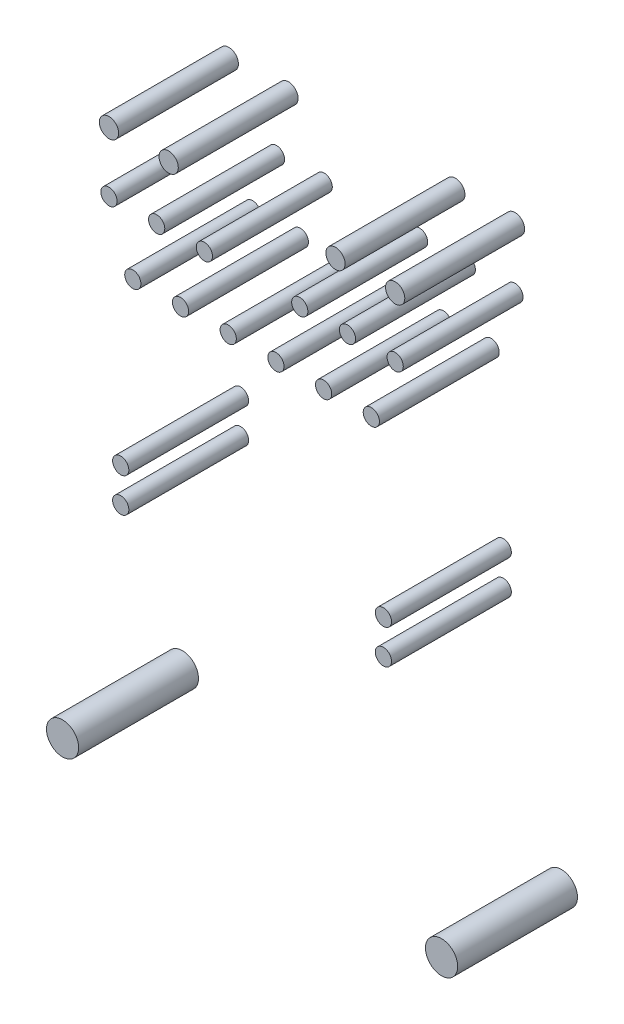
ISO-10303-21;
HEADER;
FILE_DESCRIPTION(('STEP AP214'),'2;1');
FILE_NAME('part.step','',(''),(''),'','','');
FILE_SCHEMA(('AUTOMOTIVE_DESIGN { 1 0 10303 214 1 1 1 1 }'));
ENDSEC;
DATA;
#1=APPLICATION_CONTEXT('core data for automotive mechanical design processes');
#2=APPLICATION_PROTOCOL_DEFINITION('international standard','automotive_design',2000,#1);
#3=PRODUCT_CONTEXT('',#1,'mechanical');
#4=PRODUCT('Part','Part','',(#3));
#5=PRODUCT_RELATED_PRODUCT_CATEGORY('part','',(#4));
#6=PRODUCT_DEFINITION_FORMATION('','',#4);
#7=PRODUCT_DEFINITION_CONTEXT('part definition',#1,'design');
#8=PRODUCT_DEFINITION('design','',#6,#7);
#9=PRODUCT_DEFINITION_SHAPE('','',#8);
#10=(LENGTH_UNIT() NAMED_UNIT(*) SI_UNIT(.MILLI.,.METRE.));
#11=(NAMED_UNIT(*) PLANE_ANGLE_UNIT() SI_UNIT($,.RADIAN.));
#12=(NAMED_UNIT(*) SI_UNIT($,.STERADIAN.) SOLID_ANGLE_UNIT());
#13=UNCERTAINTY_MEASURE_WITH_UNIT(LENGTH_MEASURE(1.E-05),#10,'distance_accuracy_value','');
#14=(GEOMETRIC_REPRESENTATION_CONTEXT(3) GLOBAL_UNCERTAINTY_ASSIGNED_CONTEXT((#13)) GLOBAL_UNIT_ASSIGNED_CONTEXT((#10,
#11,#12)) REPRESENTATION_CONTEXT('',''));
#15=CARTESIAN_POINT('',(0.,0.,0.));
#16=DIRECTION('',(0.,0.,1.));
#17=DIRECTION('',(1.,0.,0.));
#18=AXIS2_PLACEMENT_3D('',#15,#16,#17);
#19=CARTESIAN_POINT('',(0.,0.,-5.));
#20=DIRECTION('',(0.,0.,1.));
#21=DIRECTION('',(1.,0.,0.));
#22=AXIS2_PLACEMENT_3D('',#19,#20,#21);
#23=PLANE('',#22);
#24=CARTESIAN_POINT('',(0.,0.,-5.));
#25=DIRECTION('',(0.,0.,1.));
#26=DIRECTION('',(1.,0.,0.));
#27=AXIS2_PLACEMENT_3D('',#24,#25,#26);
#28=CIRCLE('',#27,0.345);
#29=CARTESIAN_POINT('',(0.345,0.,-5.));
#30=VERTEX_POINT('',#29);
#31=EDGE_CURVE('P0_E11',#30,#30,#28,.T.);
#32=ORIENTED_EDGE('',*,*,#31,.F.);
#33=EDGE_LOOP('',(#32));
#34=FACE_BOUND('',#33,.T.);
#35=ADVANCED_FACE('P0_F16',(#34),#23,.F.);
#36=CARTESIAN_POINT('',(0.,0.,0.1));
#37=DIRECTION('',(0.,0.,1.));
#38=DIRECTION('',(1.,0.,0.));
#39=AXIS2_PLACEMENT_3D('',#36,#37,#38);
#40=PLANE('',#39);
#41=CARTESIAN_POINT('',(0.,0.,0.1));
#42=DIRECTION('',(0.,0.,1.));
#43=DIRECTION('',(1.,0.,0.));
#44=AXIS2_PLACEMENT_3D('',#41,#42,#43);
#45=CIRCLE('',#44,0.345);
#46=CARTESIAN_POINT('',(0.345,0.,0.1));
#47=VERTEX_POINT('',#46);
#48=EDGE_CURVE('P0_E20',#47,#47,#45,.T.);
#49=ORIENTED_EDGE('',*,*,#48,.T.);
#50=EDGE_LOOP('',(#49));
#51=FACE_BOUND('',#50,.T.);
#52=ADVANCED_FACE('P0_F44',(#51),#40,.T.);
#53=CARTESIAN_POINT('',(0.,0.,-5.));
#54=DIRECTION('',(0.,0.,1.));
#55=DIRECTION('',(1.,0.,0.));
#56=AXIS2_PLACEMENT_3D('',#53,#54,#55);
#57=CYLINDRICAL_SURFACE('',#56,0.345);
#58=ORIENTED_EDGE('',*,*,#48,.F.);
#59=DIRECTION('',(0.,0.,1.));
#60=VECTOR('',#59,1.);
#61=CARTESIAN_POINT('',(0.345,0.,-5.));
#62=LINE('',#61,#60);
#63=EDGE_CURVE('P0_E27',#30,#47,#62,.T.);
#64=ORIENTED_EDGE('',*,*,#63,.F.);
#65=ORIENTED_EDGE('',*,*,#31,.T.);
#66=ORIENTED_EDGE('',*,*,#63,.T.);
#67=EDGE_LOOP('',(#58,#64,#65,#66));
#68=FACE_BOUND('',#67,.T.);
#69=ADVANCED_FACE('P0_F18',(#68),#57,.T.);
#70=CLOSED_SHELL('',(#35,#52,#69));
#71=MANIFOLD_SOLID_BREP('P0_B1',#70);
#72=CARTESIAN_POINT('',(-2.03,0.,-5.));
#73=DIRECTION('',(0.,0.,1.));
#74=DIRECTION('',(1.,0.,0.));
#75=AXIS2_PLACEMENT_3D('',#72,#73,#74);
#76=PLANE('',#75);
#77=CARTESIAN_POINT('',(-2.03,0.,-5.));
#78=DIRECTION('',(0.,0.,1.));
#79=DIRECTION('',(1.,0.,0.));
#80=AXIS2_PLACEMENT_3D('',#77,#78,#79);
#81=CIRCLE('',#80,0.345);
#82=CARTESIAN_POINT('',(-1.685,0.,-5.));
#83=VERTEX_POINT('',#82);
#84=EDGE_CURVE('P1_E11',#83,#83,#81,.T.);
#85=ORIENTED_EDGE('',*,*,#84,.F.);
#86=EDGE_LOOP('',(#85));
#87=FACE_BOUND('',#86,.T.);
#88=ADVANCED_FACE('P1_F16',(#87),#76,.F.);
#89=CARTESIAN_POINT('',(-2.03,0.,0.1));
#90=DIRECTION('',(0.,0.,1.));
#91=DIRECTION('',(1.,0.,0.));
#92=AXIS2_PLACEMENT_3D('',#89,#90,#91);
#93=PLANE('',#92);
#94=CARTESIAN_POINT('',(-2.03,0.,0.1));
#95=DIRECTION('',(0.,0.,1.));
#96=DIRECTION('',(1.,0.,0.));
#97=AXIS2_PLACEMENT_3D('',#94,#95,#96);
#98=CIRCLE('',#97,0.345);
#99=CARTESIAN_POINT('',(-1.685,0.,0.1));
#100=VERTEX_POINT('',#99);
#101=EDGE_CURVE('P1_E41',#100,#100,#98,.T.);
#102=ORIENTED_EDGE('',*,*,#101,.T.);
#103=EDGE_LOOP('',(#102));
#104=FACE_BOUND('',#103,.T.);
#105=ADVANCED_FACE('P1_F18',(#104),#93,.T.);
#106=CARTESIAN_POINT('',(-2.03,0.,-5.));
#107=DIRECTION('',(0.,0.,1.));
#108=DIRECTION('',(1.,0.,0.));
#109=AXIS2_PLACEMENT_3D('',#106,#107,#108);
#110=CYLINDRICAL_SURFACE('',#109,0.345);
#111=ORIENTED_EDGE('',*,*,#101,.F.);
#112=DIRECTION('',(0.,0.,1.));
#113=VECTOR('',#112,1.);
#114=CARTESIAN_POINT('',(-1.685,0.,-5.));
#115=LINE('',#114,#113);
#116=EDGE_CURVE('P1_E26',#83,#100,#115,.T.);
#117=ORIENTED_EDGE('',*,*,#116,.F.);
#118=ORIENTED_EDGE('',*,*,#84,.T.);
#119=ORIENTED_EDGE('',*,*,#116,.T.);
#120=EDGE_LOOP('',(#111,#117,#118,#119));
#121=FACE_BOUND('',#120,.T.);
#122=ADVANCED_FACE('P1_F40',(#121),#110,.T.);
#123=CLOSED_SHELL('',(#88,#105,#122));
#124=MANIFOLD_SOLID_BREP('P1_B1',#123);
#125=CARTESIAN_POINT('',(-4.06,0.,-5.));
#126=DIRECTION('',(0.,0.,1.));
#127=DIRECTION('',(1.,0.,0.));
#128=AXIS2_PLACEMENT_3D('',#125,#126,#127);
#129=PLANE('',#128);
#130=CARTESIAN_POINT('',(-4.06,0.,-5.));
#131=DIRECTION('',(0.,0.,1.));
#132=DIRECTION('',(1.,0.,0.));
#133=AXIS2_PLACEMENT_3D('',#130,#131,#132);
#134=CIRCLE('',#133,0.345);
#135=CARTESIAN_POINT('',(-3.715,0.,-5.));
#136=VERTEX_POINT('',#135);
#137=EDGE_CURVE('P2_E11',#136,#136,#134,.T.);
#138=ORIENTED_EDGE('',*,*,#137,.F.);
#139=EDGE_LOOP('',(#138));
#140=FACE_BOUND('',#139,.T.);
#141=ADVANCED_FACE('P2_F16',(#140),#129,.F.);
#142=CARTESIAN_POINT('',(-4.06,0.,0.1));
#143=DIRECTION('',(0.,0.,1.));
#144=DIRECTION('',(1.,0.,0.));
#145=AXIS2_PLACEMENT_3D('',#142,#143,#144);
#146=PLANE('',#145);
#147=CARTESIAN_POINT('',(-4.06,0.,0.1));
#148=DIRECTION('',(0.,0.,1.));
#149=DIRECTION('',(1.,0.,0.));
#150=AXIS2_PLACEMENT_3D('',#147,#148,#149);
#151=CIRCLE('',#150,0.345);
#152=CARTESIAN_POINT('',(-3.715,0.,0.1));
#153=VERTEX_POINT('',#152);
#154=EDGE_CURVE('P2_E40',#153,#153,#151,.T.);
#155=ORIENTED_EDGE('',*,*,#154,.T.);
#156=EDGE_LOOP('',(#155));
#157=FACE_BOUND('',#156,.T.);
#158=ADVANCED_FACE('P2_F44',(#157),#146,.T.);
#159=CARTESIAN_POINT('',(-4.06,0.,-5.));
#160=DIRECTION('',(0.,0.,1.));
#161=DIRECTION('',(1.,0.,0.));
#162=AXIS2_PLACEMENT_3D('',#159,#160,#161);
#163=CYLINDRICAL_SURFACE('',#162,0.345);
#164=ORIENTED_EDGE('',*,*,#154,.F.);
#165=DIRECTION('',(0.,0.,1.));
#166=VECTOR('',#165,1.);
#167=CARTESIAN_POINT('',(-3.715,0.,-5.));
#168=LINE('',#167,#166);
#169=EDGE_CURVE('P2_E25',#136,#153,#168,.T.);
#170=ORIENTED_EDGE('',*,*,#169,.F.);
#171=ORIENTED_EDGE('',*,*,#137,.T.);
#172=ORIENTED_EDGE('',*,*,#169,.T.);
#173=EDGE_LOOP('',(#164,#170,#171,#172));
#174=FACE_BOUND('',#173,.T.);
#175=ADVANCED_FACE('P2_F18',(#174),#163,.T.);
#176=CLOSED_SHELL('',(#141,#158,#175));
#177=MANIFOLD_SOLID_BREP('P2_B1',#176);
#178=CARTESIAN_POINT('',(-6.09,0.,-5.));
#179=DIRECTION('',(0.,0.,1.));
#180=DIRECTION('',(1.,0.,0.));
#181=AXIS2_PLACEMENT_3D('',#178,#179,#180);
#182=PLANE('',#181);
#183=CARTESIAN_POINT('',(-6.09,0.,-5.));
#184=DIRECTION('',(0.,0.,1.));
#185=DIRECTION('',(1.,0.,0.));
#186=AXIS2_PLACEMENT_3D('',#183,#184,#185);
#187=CIRCLE('',#186,0.345);
#188=CARTESIAN_POINT('',(-5.745,0.,-5.));
#189=VERTEX_POINT('',#188);
#190=EDGE_CURVE('P3_E11',#189,#189,#187,.T.);
#191=ORIENTED_EDGE('',*,*,#190,.F.);
#192=EDGE_LOOP('',(#191));
#193=FACE_BOUND('',#192,.T.);
#194=ADVANCED_FACE('P3_F16',(#193),#182,.F.);
#195=CARTESIAN_POINT('',(-6.09,0.,0.1));
#196=DIRECTION('',(0.,0.,1.));
#197=DIRECTION('',(1.,0.,0.));
#198=AXIS2_PLACEMENT_3D('',#195,#196,#197);
#199=PLANE('',#198);
#200=CARTESIAN_POINT('',(-6.09,0.,0.1));
#201=DIRECTION('',(0.,0.,1.));
#202=DIRECTION('',(1.,0.,0.));
#203=AXIS2_PLACEMENT_3D('',#200,#201,#202);
#204=CIRCLE('',#203,0.345);
#205=CARTESIAN_POINT('',(-5.745,0.,0.1));
#206=VERTEX_POINT('',#205);
#207=EDGE_CURVE('P3_E20',#206,#206,#204,.T.);
#208=ORIENTED_EDGE('',*,*,#207,.T.);
#209=EDGE_LOOP('',(#208));
#210=FACE_BOUND('',#209,.T.);
#211=ADVANCED_FACE('P3_F18',(#210),#199,.T.);
#212=CARTESIAN_POINT('',(-6.09,0.,-5.));
#213=DIRECTION('',(0.,0.,1.));
#214=DIRECTION('',(1.,0.,0.));
#215=AXIS2_PLACEMENT_3D('',#212,#213,#214);
#216=CYLINDRICAL_SURFACE('',#215,0.345);
#217=ORIENTED_EDGE('',*,*,#207,.F.);
#218=DIRECTION('',(0.,0.,1.));
#219=VECTOR('',#218,1.);
#220=CARTESIAN_POINT('',(-5.745,0.,-5.));
#221=LINE('',#220,#219);
#222=EDGE_CURVE('P3_E26',#189,#206,#221,.T.);
#223=ORIENTED_EDGE('',*,*,#222,.F.);
#224=ORIENTED_EDGE('',*,*,#190,.T.);
#225=ORIENTED_EDGE('',*,*,#222,.T.);
#226=EDGE_LOOP('',(#217,#223,#224,#225));
#227=FACE_BOUND('',#226,.T.);
#228=ADVANCED_FACE('P3_F42',(#227),#216,.T.);
#229=CLOSED_SHELL('',(#194,#211,#228));
#230=MANIFOLD_SOLID_BREP('P3_B1',#229);
#231=CARTESIAN_POINT('',(-8.12,0.,-5.));
#232=DIRECTION('',(0.,0.,1.));
#233=DIRECTION('',(1.,0.,0.));
#234=AXIS2_PLACEMENT_3D('',#231,#232,#233);
#235=PLANE('',#234);
#236=CARTESIAN_POINT('',(-8.12,0.,-5.));
#237=DIRECTION('',(0.,0.,1.));
#238=DIRECTION('',(1.,0.,0.));
#239=AXIS2_PLACEMENT_3D('',#236,#237,#238);
#240=CIRCLE('',#239,0.345);
#241=CARTESIAN_POINT('',(-7.775,0.,-5.));
#242=VERTEX_POINT('',#241);
#243=EDGE_CURVE('P4_E11',#242,#242,#240,.T.);
#244=ORIENTED_EDGE('',*,*,#243,.F.);
#245=EDGE_LOOP('',(#244));
#246=FACE_BOUND('',#245,.T.);
#247=ADVANCED_FACE('P4_F16',(#246),#235,.F.);
#248=CARTESIAN_POINT('',(-8.12,0.,0.1));
#249=DIRECTION('',(0.,0.,1.));
#250=DIRECTION('',(1.,0.,0.));
#251=AXIS2_PLACEMENT_3D('',#248,#249,#250);
#252=PLANE('',#251);
#253=CARTESIAN_POINT('',(-8.12,0.,0.1));
#254=DIRECTION('',(0.,0.,1.));
#255=DIRECTION('',(1.,0.,0.));
#256=AXIS2_PLACEMENT_3D('',#253,#254,#255);
#257=CIRCLE('',#256,0.345);
#258=CARTESIAN_POINT('',(-7.775,0.,0.1));
#259=VERTEX_POINT('',#258);
#260=EDGE_CURVE('P4_E20',#259,#259,#257,.T.);
#261=ORIENTED_EDGE('',*,*,#260,.T.);
#262=EDGE_LOOP('',(#261));
#263=FACE_BOUND('',#262,.T.);
#264=ADVANCED_FACE('P4_F44',(#263),#252,.T.);
#265=CARTESIAN_POINT('',(-8.12,0.,-5.));
#266=DIRECTION('',(0.,0.,1.));
#267=DIRECTION('',(1.,0.,0.));
#268=AXIS2_PLACEMENT_3D('',#265,#266,#267);
#269=CYLINDRICAL_SURFACE('',#268,0.345);
#270=ORIENTED_EDGE('',*,*,#260,.F.);
#271=DIRECTION('',(0.,0.,1.));
#272=VECTOR('',#271,1.);
#273=CARTESIAN_POINT('',(-7.775,0.,-5.));
#274=LINE('',#273,#272);
#275=EDGE_CURVE('P4_E27',#242,#259,#274,.T.);
#276=ORIENTED_EDGE('',*,*,#275,.F.);
#277=ORIENTED_EDGE('',*,*,#243,.T.);
#278=ORIENTED_EDGE('',*,*,#275,.T.);
#279=EDGE_LOOP('',(#270,#276,#277,#278));
#280=FACE_BOUND('',#279,.T.);
#281=ADVANCED_FACE('P4_F18',(#280),#269,.T.);
#282=CLOSED_SHELL('',(#247,#264,#281));
#283=MANIFOLD_SOLID_BREP('P4_B1',#282);
#284=CARTESIAN_POINT('',(-10.15,0.,-5.));
#285=DIRECTION('',(0.,0.,1.));
#286=DIRECTION('',(1.,0.,0.));
#287=AXIS2_PLACEMENT_3D('',#284,#285,#286);
#288=PLANE('',#287);
#289=CARTESIAN_POINT('',(-10.15,0.,-5.));
#290=DIRECTION('',(0.,0.,1.));
#291=DIRECTION('',(1.,0.,0.));
#292=AXIS2_PLACEMENT_3D('',#289,#290,#291);
#293=CIRCLE('',#292,0.345);
#294=CARTESIAN_POINT('',(-9.805,0.,-5.));
#295=VERTEX_POINT('',#294);
#296=EDGE_CURVE('P5_E11',#295,#295,#293,.T.);
#297=ORIENTED_EDGE('',*,*,#296,.F.);
#298=EDGE_LOOP('',(#297));
#299=FACE_BOUND('',#298,.T.);
#300=ADVANCED_FACE('P5_F16',(#299),#288,.F.);
#301=CARTESIAN_POINT('',(-10.15,0.,0.1));
#302=DIRECTION('',(0.,0.,1.));
#303=DIRECTION('',(1.,0.,0.));
#304=AXIS2_PLACEMENT_3D('',#301,#302,#303);
#305=PLANE('',#304);
#306=CARTESIAN_POINT('',(-10.15,0.,0.1));
#307=DIRECTION('',(0.,0.,1.));
#308=DIRECTION('',(1.,0.,0.));
#309=AXIS2_PLACEMENT_3D('',#306,#307,#308);
#310=CIRCLE('',#309,0.345);
#311=CARTESIAN_POINT('',(-9.805,0.,0.1));
#312=VERTEX_POINT('',#311);
#313=EDGE_CURVE('P5_E41',#312,#312,#310,.T.);
#314=ORIENTED_EDGE('',*,*,#313,.T.);
#315=EDGE_LOOP('',(#314));
#316=FACE_BOUND('',#315,.T.);
#317=ADVANCED_FACE('P5_F18',(#316),#305,.T.);
#318=CARTESIAN_POINT('',(-10.15,0.,-5.));
#319=DIRECTION('',(0.,0.,1.));
#320=DIRECTION('',(1.,0.,0.));
#321=AXIS2_PLACEMENT_3D('',#318,#319,#320);
#322=CYLINDRICAL_SURFACE('',#321,0.345);
#323=ORIENTED_EDGE('',*,*,#313,.F.);
#324=DIRECTION('',(0.,0.,1.));
#325=VECTOR('',#324,1.);
#326=CARTESIAN_POINT('',(-9.805,0.,-5.));
#327=LINE('',#326,#325);
#328=EDGE_CURVE('P5_E26',#295,#312,#327,.T.);
#329=ORIENTED_EDGE('',*,*,#328,.F.);
#330=ORIENTED_EDGE('',*,*,#296,.T.);
#331=ORIENTED_EDGE('',*,*,#328,.T.);
#332=EDGE_LOOP('',(#323,#329,#330,#331));
#333=FACE_BOUND('',#332,.T.);
#334=ADVANCED_FACE('P5_F40',(#333),#322,.T.);
#335=CLOSED_SHELL('',(#300,#317,#334));
#336=MANIFOLD_SOLID_BREP('P5_B1',#335);
#337=CARTESIAN_POINT('',(1.015,2.54,-5.));
#338=DIRECTION('',(0.,0.,1.));
#339=DIRECTION('',(1.,0.,0.));
#340=AXIS2_PLACEMENT_3D('',#337,#338,#339);
#341=PLANE('',#340);
#342=CARTESIAN_POINT('',(1.015,2.54,-5.));
#343=DIRECTION('',(0.,0.,1.));
#344=DIRECTION('',(1.,0.,0.));
#345=AXIS2_PLACEMENT_3D('',#342,#343,#344);
#346=CIRCLE('',#345,0.345);
#347=CARTESIAN_POINT('',(1.36,2.54,-5.));
#348=VERTEX_POINT('',#347);
#349=EDGE_CURVE('P6_E11',#348,#348,#346,.T.);
#350=ORIENTED_EDGE('',*,*,#349,.F.);
#351=EDGE_LOOP('',(#350));
#352=FACE_BOUND('',#351,.T.);
#353=ADVANCED_FACE('P6_F16',(#352),#341,.F.);
#354=CARTESIAN_POINT('',(1.015,2.54,0.1));
#355=DIRECTION('',(0.,0.,1.));
#356=DIRECTION('',(1.,0.,0.));
#357=AXIS2_PLACEMENT_3D('',#354,#355,#356);
#358=PLANE('',#357);
#359=CARTESIAN_POINT('',(1.015,2.54,0.1));
#360=DIRECTION('',(0.,0.,1.));
#361=DIRECTION('',(1.,0.,0.));
#362=AXIS2_PLACEMENT_3D('',#359,#360,#361);
#363=CIRCLE('',#362,0.345);
#364=CARTESIAN_POINT('',(1.36,2.54,0.1));
#365=VERTEX_POINT('',#364);
#366=EDGE_CURVE('P6_E20',#365,#365,#363,.T.);
#367=ORIENTED_EDGE('',*,*,#366,.T.);
#368=EDGE_LOOP('',(#367));
#369=FACE_BOUND('',#368,.T.);
#370=ADVANCED_FACE('P6_F18',(#369),#358,.T.);
#371=CARTESIAN_POINT('',(1.015,2.54,-5.));
#372=DIRECTION('',(0.,0.,1.));
#373=DIRECTION('',(1.,0.,0.));
#374=AXIS2_PLACEMENT_3D('',#371,#372,#373);
#375=CYLINDRICAL_SURFACE('',#374,0.345);
#376=ORIENTED_EDGE('',*,*,#366,.F.);
#377=DIRECTION('',(0.,0.,1.));
#378=VECTOR('',#377,1.);
#379=CARTESIAN_POINT('',(1.36,2.54,-5.));
#380=LINE('',#379,#378);
#381=EDGE_CURVE('P6_E26',#348,#365,#380,.T.);
#382=ORIENTED_EDGE('',*,*,#381,.F.);
#383=ORIENTED_EDGE('',*,*,#349,.T.);
#384=ORIENTED_EDGE('',*,*,#381,.T.);
#385=EDGE_LOOP('',(#376,#382,#383,#384));
#386=FACE_BOUND('',#385,.T.);
#387=ADVANCED_FACE('P6_F41',(#386),#375,.T.);
#388=CLOSED_SHELL('',(#353,#370,#387));
#389=MANIFOLD_SOLID_BREP('P6_B1',#388);
#390=CARTESIAN_POINT('',(-1.015,2.54,-5.));
#391=DIRECTION('',(0.,0.,1.));
#392=DIRECTION('',(1.,0.,0.));
#393=AXIS2_PLACEMENT_3D('',#390,#391,#392);
#394=PLANE('',#393);
#395=CARTESIAN_POINT('',(-1.015,2.54,-5.));
#396=DIRECTION('',(0.,0.,1.));
#397=DIRECTION('',(1.,0.,0.));
#398=AXIS2_PLACEMENT_3D('',#395,#396,#397);
#399=CIRCLE('',#398,0.345);
#400=CARTESIAN_POINT('',(-0.67,2.54,-5.));
#401=VERTEX_POINT('',#400);
#402=EDGE_CURVE('P7_E11',#401,#401,#399,.T.);
#403=ORIENTED_EDGE('',*,*,#402,.F.);
#404=EDGE_LOOP('',(#403));
#405=FACE_BOUND('',#404,.T.);
#406=ADVANCED_FACE('P7_F16',(#405),#394,.F.);
#407=CARTESIAN_POINT('',(-1.015,2.54,0.1));
#408=DIRECTION('',(0.,0.,1.));
#409=DIRECTION('',(1.,0.,0.));
#410=AXIS2_PLACEMENT_3D('',#407,#408,#409);
#411=PLANE('',#410);
#412=CARTESIAN_POINT('',(-1.015,2.54,0.1));
#413=DIRECTION('',(0.,0.,1.));
#414=DIRECTION('',(1.,0.,0.));
#415=AXIS2_PLACEMENT_3D('',#412,#413,#414);
#416=CIRCLE('',#415,0.345);
#417=CARTESIAN_POINT('',(-0.67,2.54,0.1));
#418=VERTEX_POINT('',#417);
#419=EDGE_CURVE('P7_E19',#418,#418,#416,.T.);
#420=ORIENTED_EDGE('',*,*,#419,.T.);
#421=EDGE_LOOP('',(#420));
#422=FACE_BOUND('',#421,.T.);
#423=ADVANCED_FACE('P7_F44',(#422),#411,.T.);
#424=CARTESIAN_POINT('',(-1.015,2.54,-5.));
#425=DIRECTION('',(0.,0.,1.));
#426=DIRECTION('',(1.,0.,0.));
#427=AXIS2_PLACEMENT_3D('',#424,#425,#426);
#428=CYLINDRICAL_SURFACE('',#427,0.345);
#429=ORIENTED_EDGE('',*,*,#419,.F.);
#430=DIRECTION('',(0.,0.,1.));
#431=VECTOR('',#430,1.);
#432=CARTESIAN_POINT('',(-0.67,2.54,-5.));
#433=LINE('',#432,#431);
#434=EDGE_CURVE('P7_E25',#401,#418,#433,.T.);
#435=ORIENTED_EDGE('',*,*,#434,.F.);
#436=ORIENTED_EDGE('',*,*,#402,.T.);
#437=ORIENTED_EDGE('',*,*,#434,.T.);
#438=EDGE_LOOP('',(#429,#435,#436,#437));
#439=FACE_BOUND('',#438,.T.);
#440=ADVANCED_FACE('P7_F40',(#439),#428,.T.);
#441=CLOSED_SHELL('',(#406,#423,#440));
#442=MANIFOLD_SOLID_BREP('P7_B1',#441);
#443=CARTESIAN_POINT('',(-3.045,2.54,-5.));
#444=DIRECTION('',(0.,0.,1.));
#445=DIRECTION('',(1.,0.,0.));
#446=AXIS2_PLACEMENT_3D('',#443,#444,#445);
#447=PLANE('',#446);
#448=CARTESIAN_POINT('',(-3.045,2.54,-5.));
#449=DIRECTION('',(0.,0.,1.));
#450=DIRECTION('',(1.,0.,0.));
#451=AXIS2_PLACEMENT_3D('',#448,#449,#450);
#452=CIRCLE('',#451,0.345);
#453=CARTESIAN_POINT('',(-2.7,2.54,-5.));
#454=VERTEX_POINT('',#453);
#455=EDGE_CURVE('P8_E11',#454,#454,#452,.T.);
#456=ORIENTED_EDGE('',*,*,#455,.F.);
#457=EDGE_LOOP('',(#456));
#458=FACE_BOUND('',#457,.T.);
#459=ADVANCED_FACE('P8_F16',(#458),#447,.F.);
#460=CARTESIAN_POINT('',(-3.045,2.54,0.1));
#461=DIRECTION('',(0.,0.,1.));
#462=DIRECTION('',(1.,0.,0.));
#463=AXIS2_PLACEMENT_3D('',#460,#461,#462);
#464=PLANE('',#463);
#465=CARTESIAN_POINT('',(-3.045,2.54,0.1));
#466=DIRECTION('',(0.,0.,1.));
#467=DIRECTION('',(1.,0.,0.));
#468=AXIS2_PLACEMENT_3D('',#465,#466,#467);
#469=CIRCLE('',#468,0.345);
#470=CARTESIAN_POINT('',(-2.7,2.54,0.1));
#471=VERTEX_POINT('',#470);
#472=EDGE_CURVE('P8_E20',#471,#471,#469,.T.);
#473=ORIENTED_EDGE('',*,*,#472,.T.);
#474=EDGE_LOOP('',(#473));
#475=FACE_BOUND('',#474,.T.);
#476=ADVANCED_FACE('P8_F44',(#475),#464,.T.);
#477=CARTESIAN_POINT('',(-3.045,2.54,-5.));
#478=DIRECTION('',(0.,0.,1.));
#479=DIRECTION('',(1.,0.,0.));
#480=AXIS2_PLACEMENT_3D('',#477,#478,#479);
#481=CYLINDRICAL_SURFACE('',#480,0.345);
#482=ORIENTED_EDGE('',*,*,#472,.F.);
#483=DIRECTION('',(0.,0.,1.));
#484=VECTOR('',#483,1.);
#485=CARTESIAN_POINT('',(-2.7,2.54,-5.));
#486=LINE('',#485,#484);
#487=EDGE_CURVE('P8_E26',#454,#471,#486,.T.);
#488=ORIENTED_EDGE('',*,*,#487,.F.);
#489=ORIENTED_EDGE('',*,*,#455,.T.);
#490=ORIENTED_EDGE('',*,*,#487,.T.);
#491=EDGE_LOOP('',(#482,#488,#489,#490));
#492=FACE_BOUND('',#491,.T.);
#493=ADVANCED_FACE('P8_F18',(#492),#481,.T.);
#494=CLOSED_SHELL('',(#459,#476,#493));
#495=MANIFOLD_SOLID_BREP('P8_B1',#494);
#496=CARTESIAN_POINT('',(-7.105,2.54,-5.));
#497=DIRECTION('',(0.,0.,1.));
#498=DIRECTION('',(1.,0.,0.));
#499=AXIS2_PLACEMENT_3D('',#496,#497,#498);
#500=PLANE('',#499);
#501=CARTESIAN_POINT('',(-7.105,2.54,-5.));
#502=DIRECTION('',(0.,0.,1.));
#503=DIRECTION('',(1.,0.,0.));
#504=AXIS2_PLACEMENT_3D('',#501,#502,#503);
#505=CIRCLE('',#504,0.345);
#506=CARTESIAN_POINT('',(-6.76,2.54,-5.));
#507=VERTEX_POINT('',#506);
#508=EDGE_CURVE('P9_E11',#507,#507,#505,.T.);
#509=ORIENTED_EDGE('',*,*,#508,.F.);
#510=EDGE_LOOP('',(#509));
#511=FACE_BOUND('',#510,.T.);
#512=ADVANCED_FACE('P9_F16',(#511),#500,.F.);
#513=CARTESIAN_POINT('',(-7.105,2.54,0.1));
#514=DIRECTION('',(0.,0.,1.));
#515=DIRECTION('',(1.,0.,0.));
#516=AXIS2_PLACEMENT_3D('',#513,#514,#515);
#517=PLANE('',#516);
#518=CARTESIAN_POINT('',(-7.105,2.54,0.1));
#519=DIRECTION('',(0.,0.,1.));
#520=DIRECTION('',(1.,0.,0.));
#521=AXIS2_PLACEMENT_3D('',#518,#519,#520);
#522=CIRCLE('',#521,0.345);
#523=CARTESIAN_POINT('',(-6.76,2.54,0.1));
#524=VERTEX_POINT('',#523);
#525=EDGE_CURVE('P9_E40',#524,#524,#522,.T.);
#526=ORIENTED_EDGE('',*,*,#525,.T.);
#527=EDGE_LOOP('',(#526));
#528=FACE_BOUND('',#527,.T.);
#529=ADVANCED_FACE('P9_F43',(#528),#517,.T.);
#530=CARTESIAN_POINT('',(-7.105,2.54,-5.));
#531=DIRECTION('',(0.,0.,1.));
#532=DIRECTION('',(1.,0.,0.));
#533=AXIS2_PLACEMENT_3D('',#530,#531,#532);
#534=CYLINDRICAL_SURFACE('',#533,0.345);
#535=ORIENTED_EDGE('',*,*,#525,.F.);
#536=DIRECTION('',(0.,0.,1.));
#537=VECTOR('',#536,1.);
#538=CARTESIAN_POINT('',(-6.76,2.54,-5.));
#539=LINE('',#538,#537);
#540=EDGE_CURVE('P9_E25',#507,#524,#539,.T.);
#541=ORIENTED_EDGE('',*,*,#540,.F.);
#542=ORIENTED_EDGE('',*,*,#508,.T.);
#543=ORIENTED_EDGE('',*,*,#540,.T.);
#544=EDGE_LOOP('',(#535,#541,#542,#543));
#545=FACE_BOUND('',#544,.T.);
#546=ADVANCED_FACE('P9_F18',(#545),#534,.T.);
#547=CLOSED_SHELL('',(#512,#529,#546));
#548=MANIFOLD_SOLID_BREP('P9_B1',#547);
#549=CARTESIAN_POINT('',(-9.135,2.54,-5.));
#550=DIRECTION('',(0.,0.,1.));
#551=DIRECTION('',(1.,0.,0.));
#552=AXIS2_PLACEMENT_3D('',#549,#550,#551);
#553=PLANE('',#552);
#554=CARTESIAN_POINT('',(-9.135,2.54,-5.));
#555=DIRECTION('',(0.,0.,1.));
#556=DIRECTION('',(1.,0.,0.));
#557=AXIS2_PLACEMENT_3D('',#554,#555,#556);
#558=CIRCLE('',#557,0.345);
#559=CARTESIAN_POINT('',(-8.79,2.54,-5.));
#560=VERTEX_POINT('',#559);
#561=EDGE_CURVE('P10_E11',#560,#560,#558,.T.);
#562=ORIENTED_EDGE('',*,*,#561,.F.);
#563=EDGE_LOOP('',(#562));
#564=FACE_BOUND('',#563,.T.);
#565=ADVANCED_FACE('P10_F16',(#564),#553,.F.);
#566=CARTESIAN_POINT('',(-9.135,2.54,0.1));
#567=DIRECTION('',(0.,0.,1.));
#568=DIRECTION('',(1.,0.,0.));
#569=AXIS2_PLACEMENT_3D('',#566,#567,#568);
#570=PLANE('',#569);
#571=CARTESIAN_POINT('',(-9.135,2.54,0.1));
#572=DIRECTION('',(0.,0.,1.));
#573=DIRECTION('',(1.,0.,0.));
#574=AXIS2_PLACEMENT_3D('',#571,#572,#573);
#575=CIRCLE('',#574,0.345);
#576=CARTESIAN_POINT('',(-8.79,2.54,0.1));
#577=VERTEX_POINT('',#576);
#578=EDGE_CURVE('P10_E19',#577,#577,#575,.T.);
#579=ORIENTED_EDGE('',*,*,#578,.T.);
#580=EDGE_LOOP('',(#579));
#581=FACE_BOUND('',#580,.T.);
#582=ADVANCED_FACE('P10_F44',(#581),#570,.T.);
#583=CARTESIAN_POINT('',(-9.135,2.54,-5.));
#584=DIRECTION('',(0.,0.,1.));
#585=DIRECTION('',(1.,0.,0.));
#586=AXIS2_PLACEMENT_3D('',#583,#584,#585);
#587=CYLINDRICAL_SURFACE('',#586,0.345);
#588=ORIENTED_EDGE('',*,*,#578,.F.);
#589=DIRECTION('',(0.,0.,1.));
#590=VECTOR('',#589,1.);
#591=CARTESIAN_POINT('',(-8.79,2.54,-5.));
#592=LINE('',#591,#590);
#593=EDGE_CURVE('P10_E26',#560,#577,#592,.T.);
#594=ORIENTED_EDGE('',*,*,#593,.F.);
#595=ORIENTED_EDGE('',*,*,#561,.T.);
#596=ORIENTED_EDGE('',*,*,#593,.T.);
#597=EDGE_LOOP('',(#588,#594,#595,#596));
#598=FACE_BOUND('',#597,.T.);
#599=ADVANCED_FACE('P10_F40',(#598),#587,.T.);
#600=CLOSED_SHELL('',(#565,#582,#599));
#601=MANIFOLD_SOLID_BREP('P10_B1',#600);
#602=CARTESIAN_POINT('',(-11.165,2.54,-5.));
#603=DIRECTION('',(0.,0.,1.));
#604=DIRECTION('',(1.,0.,0.));
#605=AXIS2_PLACEMENT_3D('',#602,#603,#604);
#606=PLANE('',#605);
#607=CARTESIAN_POINT('',(-11.165,2.54,-5.));
#608=DIRECTION('',(0.,0.,1.));
#609=DIRECTION('',(1.,0.,0.));
#610=AXIS2_PLACEMENT_3D('',#607,#608,#609);
#611=CIRCLE('',#610,0.345);
#612=CARTESIAN_POINT('',(-10.82,2.54,-5.));
#613=VERTEX_POINT('',#612);
#614=EDGE_CURVE('P11_E11',#613,#613,#611,.T.);
#615=ORIENTED_EDGE('',*,*,#614,.F.);
#616=EDGE_LOOP('',(#615));
#617=FACE_BOUND('',#616,.T.);
#618=ADVANCED_FACE('P11_F16',(#617),#606,.F.);
#619=CARTESIAN_POINT('',(-11.165,2.54,0.1));
#620=DIRECTION('',(0.,0.,1.));
#621=DIRECTION('',(1.,0.,0.));
#622=AXIS2_PLACEMENT_3D('',#619,#620,#621);
#623=PLANE('',#622);
#624=CARTESIAN_POINT('',(-11.165,2.54,0.1));
#625=DIRECTION('',(0.,0.,1.));
#626=DIRECTION('',(1.,0.,0.));
#627=AXIS2_PLACEMENT_3D('',#624,#625,#626);
#628=CIRCLE('',#627,0.345);
#629=CARTESIAN_POINT('',(-10.82,2.54,0.1));
#630=VERTEX_POINT('',#629);
#631=EDGE_CURVE('P11_E40',#630,#630,#628,.T.);
#632=ORIENTED_EDGE('',*,*,#631,.T.);
#633=EDGE_LOOP('',(#632));
#634=FACE_BOUND('',#633,.T.);
#635=ADVANCED_FACE('P11_F44',(#634),#623,.T.);
#636=CARTESIAN_POINT('',(-11.165,2.54,-5.));
#637=DIRECTION('',(0.,0.,1.));
#638=DIRECTION('',(1.,0.,0.));
#639=AXIS2_PLACEMENT_3D('',#636,#637,#638);
#640=CYLINDRICAL_SURFACE('',#639,0.345);
#641=ORIENTED_EDGE('',*,*,#631,.F.);
#642=DIRECTION('',(0.,0.,1.));
#643=VECTOR('',#642,1.);
#644=CARTESIAN_POINT('',(-10.82,2.54,-5.));
#645=LINE('',#644,#643);
#646=EDGE_CURVE('P11_E25',#613,#630,#645,.T.);
#647=ORIENTED_EDGE('',*,*,#646,.F.);
#648=ORIENTED_EDGE('',*,*,#614,.T.);
#649=ORIENTED_EDGE('',*,*,#646,.T.);
#650=EDGE_LOOP('',(#641,#647,#648,#649));
#651=FACE_BOUND('',#650,.T.);
#652=ADVANCED_FACE('P11_F18',(#651),#640,.T.);
#653=CLOSED_SHELL('',(#618,#635,#652));
#654=MANIFOLD_SOLID_BREP('P11_B1',#653);
#655=CARTESIAN_POINT('',(0.515,-7.12,-5.));
#656=DIRECTION('',(0.,0.,1.));
#657=DIRECTION('',(1.,0.,0.));
#658=AXIS2_PLACEMENT_3D('',#655,#656,#657);
#659=PLANE('',#658);
#660=CARTESIAN_POINT('',(0.515,-7.12,-5.));
#661=DIRECTION('',(0.,0.,1.));
#662=DIRECTION('',(1.,0.,0.));
#663=AXIS2_PLACEMENT_3D('',#660,#661,#662);
#664=CIRCLE('',#663,0.345);
#665=CARTESIAN_POINT('',(0.86,-7.12,-5.));
#666=VERTEX_POINT('',#665);
#667=EDGE_CURVE('P12_E11',#666,#666,#664,.T.);
#668=ORIENTED_EDGE('',*,*,#667,.F.);
#669=EDGE_LOOP('',(#668));
#670=FACE_BOUND('',#669,.T.);
#671=ADVANCED_FACE('P12_F16',(#670),#659,.F.);
#672=CARTESIAN_POINT('',(0.515,-7.12,0.1));
#673=DIRECTION('',(0.,0.,1.));
#674=DIRECTION('',(1.,0.,0.));
#675=AXIS2_PLACEMENT_3D('',#672,#673,#674);
#676=PLANE('',#675);
#677=CARTESIAN_POINT('',(0.515,-7.12,0.1));
#678=DIRECTION('',(0.,0.,1.));
#679=DIRECTION('',(1.,0.,0.));
#680=AXIS2_PLACEMENT_3D('',#677,#678,#679);
#681=CIRCLE('',#680,0.345);
#682=CARTESIAN_POINT('',(0.86,-7.12,0.1));
#683=VERTEX_POINT('',#682);
#684=EDGE_CURVE('P12_E40',#683,#683,#681,.T.);
#685=ORIENTED_EDGE('',*,*,#684,.T.);
#686=EDGE_LOOP('',(#685));
#687=FACE_BOUND('',#686,.T.);
#688=ADVANCED_FACE('P12_F43',(#687),#676,.T.);
#689=CARTESIAN_POINT('',(0.515,-7.12,-5.));
#690=DIRECTION('',(0.,0.,1.));
#691=DIRECTION('',(1.,0.,0.));
#692=AXIS2_PLACEMENT_3D('',#689,#690,#691);
#693=CYLINDRICAL_SURFACE('',#692,0.345);
#694=ORIENTED_EDGE('',*,*,#684,.F.);
#695=DIRECTION('',(0.,0.,1.));
#696=VECTOR('',#695,1.);
#697=CARTESIAN_POINT('',(0.86,-7.12,-5.));
#698=LINE('',#697,#696);
#699=EDGE_CURVE('P12_E24',#666,#683,#698,.T.);
#700=ORIENTED_EDGE('',*,*,#699,.F.);
#701=ORIENTED_EDGE('',*,*,#667,.T.);
#702=ORIENTED_EDGE('',*,*,#699,.T.);
#703=EDGE_LOOP('',(#694,#700,#701,#702));
#704=FACE_BOUND('',#703,.T.);
#705=ADVANCED_FACE('P12_F39',(#704),#693,.T.);
#706=CLOSED_SHELL('',(#671,#688,#705));
#707=MANIFOLD_SOLID_BREP('P12_B1',#706);
#708=CARTESIAN_POINT('',(-10.665,-7.12,-5.));
#709=DIRECTION('',(0.,0.,1.));
#710=DIRECTION('',(1.,0.,0.));
#711=AXIS2_PLACEMENT_3D('',#708,#709,#710);
#712=PLANE('',#711);
#713=CARTESIAN_POINT('',(-10.665,-7.12,-5.));
#714=DIRECTION('',(0.,0.,1.));
#715=DIRECTION('',(1.,0.,0.));
#716=AXIS2_PLACEMENT_3D('',#713,#714,#715);
#717=CIRCLE('',#716,0.345);
#718=CARTESIAN_POINT('',(-10.32,-7.12,-5.));
#719=VERTEX_POINT('',#718);
#720=EDGE_CURVE('P13_E11',#719,#719,#717,.T.);
#721=ORIENTED_EDGE('',*,*,#720,.F.);
#722=EDGE_LOOP('',(#721));
#723=FACE_BOUND('',#722,.T.);
#724=ADVANCED_FACE('P13_F16',(#723),#712,.F.);
#725=CARTESIAN_POINT('',(-10.665,-7.12,0.1));
#726=DIRECTION('',(0.,0.,1.));
#727=DIRECTION('',(1.,0.,0.));
#728=AXIS2_PLACEMENT_3D('',#725,#726,#727);
#729=PLANE('',#728);
#730=CARTESIAN_POINT('',(-10.665,-7.12,0.1));
#731=DIRECTION('',(0.,0.,1.));
#732=DIRECTION('',(1.,0.,0.));
#733=AXIS2_PLACEMENT_3D('',#730,#731,#732);
#734=CIRCLE('',#733,0.345);
#735=CARTESIAN_POINT('',(-10.32,-7.12,0.1));
#736=VERTEX_POINT('',#735);
#737=EDGE_CURVE('P13_E20',#736,#736,#734,.T.);
#738=ORIENTED_EDGE('',*,*,#737,.T.);
#739=EDGE_LOOP('',(#738));
#740=FACE_BOUND('',#739,.T.);
#741=ADVANCED_FACE('P13_F18',(#740),#729,.T.);
#742=CARTESIAN_POINT('',(-10.665,-7.12,-5.));
#743=DIRECTION('',(0.,0.,1.));
#744=DIRECTION('',(1.,0.,0.));
#745=AXIS2_PLACEMENT_3D('',#742,#743,#744);
#746=CYLINDRICAL_SURFACE('',#745,0.345);
#747=ORIENTED_EDGE('',*,*,#737,.F.);
#748=DIRECTION('',(0.,0.,1.));
#749=VECTOR('',#748,1.);
#750=CARTESIAN_POINT('',(-10.32,-7.12,-5.));
#751=LINE('',#750,#749);
#752=EDGE_CURVE('P13_E26',#719,#736,#751,.T.);
#753=ORIENTED_EDGE('',*,*,#752,.F.);
#754=ORIENTED_EDGE('',*,*,#720,.T.);
#755=ORIENTED_EDGE('',*,*,#752,.T.);
#756=EDGE_LOOP('',(#747,#753,#754,#755));
#757=FACE_BOUND('',#756,.T.);
#758=ADVANCED_FACE('P13_F41',(#757),#746,.T.);
#759=CLOSED_SHELL('',(#724,#741,#758));
#760=MANIFOLD_SOLID_BREP('P13_B1',#759);
#761=CARTESIAN_POINT('',(0.515,-8.58,-5.));
#762=DIRECTION('',(0.,0.,1.));
#763=DIRECTION('',(1.,0.,0.));
#764=AXIS2_PLACEMENT_3D('',#761,#762,#763);
#765=PLANE('',#764);
#766=CARTESIAN_POINT('',(0.515,-8.58,-5.));
#767=DIRECTION('',(0.,0.,1.));
#768=DIRECTION('',(1.,0.,0.));
#769=AXIS2_PLACEMENT_3D('',#766,#767,#768);
#770=CIRCLE('',#769,0.345);
#771=CARTESIAN_POINT('',(0.86,-8.58,-5.));
#772=VERTEX_POINT('',#771);
#773=EDGE_CURVE('P14_E11',#772,#772,#770,.T.);
#774=ORIENTED_EDGE('',*,*,#773,.F.);
#775=EDGE_LOOP('',(#774));
#776=FACE_BOUND('',#775,.T.);
#777=ADVANCED_FACE('P14_F16',(#776),#765,.F.);
#778=CARTESIAN_POINT('',(0.515,-8.58,0.1));
#779=DIRECTION('',(0.,0.,1.));
#780=DIRECTION('',(1.,0.,0.));
#781=AXIS2_PLACEMENT_3D('',#778,#779,#780);
#782=PLANE('',#781);
#783=CARTESIAN_POINT('',(0.515,-8.58,0.1));
#784=DIRECTION('',(0.,0.,1.));
#785=DIRECTION('',(1.,0.,0.));
#786=AXIS2_PLACEMENT_3D('',#783,#784,#785);
#787=CIRCLE('',#786,0.345);
#788=CARTESIAN_POINT('',(0.86,-8.58,0.1));
#789=VERTEX_POINT('',#788);
#790=EDGE_CURVE('P14_E40',#789,#789,#787,.T.);
#791=ORIENTED_EDGE('',*,*,#790,.T.);
#792=EDGE_LOOP('',(#791));
#793=FACE_BOUND('',#792,.T.);
#794=ADVANCED_FACE('P14_F44',(#793),#782,.T.);
#795=CARTESIAN_POINT('',(0.515,-8.58,-5.));
#796=DIRECTION('',(0.,0.,1.));
#797=DIRECTION('',(1.,0.,0.));
#798=AXIS2_PLACEMENT_3D('',#795,#796,#797);
#799=CYLINDRICAL_SURFACE('',#798,0.345);
#800=ORIENTED_EDGE('',*,*,#790,.F.);
#801=DIRECTION('',(0.,0.,1.));
#802=VECTOR('',#801,1.);
#803=CARTESIAN_POINT('',(0.86,-8.58,-5.));
#804=LINE('',#803,#802);
#805=EDGE_CURVE('P14_E25',#772,#789,#804,.T.);
#806=ORIENTED_EDGE('',*,*,#805,.F.);
#807=ORIENTED_EDGE('',*,*,#773,.T.);
#808=ORIENTED_EDGE('',*,*,#805,.T.);
#809=EDGE_LOOP('',(#800,#806,#807,#808));
#810=FACE_BOUND('',#809,.T.);
#811=ADVANCED_FACE('P14_F39',(#810),#799,.T.);
#812=CLOSED_SHELL('',(#777,#794,#811));
#813=MANIFOLD_SOLID_BREP('P14_B1',#812);
#814=CARTESIAN_POINT('',(-10.665,-8.58,-5.));
#815=DIRECTION('',(0.,0.,1.));
#816=DIRECTION('',(1.,0.,0.));
#817=AXIS2_PLACEMENT_3D('',#814,#815,#816);
#818=PLANE('',#817);
#819=CARTESIAN_POINT('',(-10.665,-8.58,-5.));
#820=DIRECTION('',(0.,0.,1.));
#821=DIRECTION('',(1.,0.,0.));
#822=AXIS2_PLACEMENT_3D('',#819,#820,#821);
#823=CIRCLE('',#822,0.345);
#824=CARTESIAN_POINT('',(-10.32,-8.58,-5.));
#825=VERTEX_POINT('',#824);
#826=EDGE_CURVE('P15_E11',#825,#825,#823,.T.);
#827=ORIENTED_EDGE('',*,*,#826,.F.);
#828=EDGE_LOOP('',(#827));
#829=FACE_BOUND('',#828,.T.);
#830=ADVANCED_FACE('P15_F16',(#829),#818,.F.);
#831=CARTESIAN_POINT('',(-10.665,-8.58,0.1));
#832=DIRECTION('',(0.,0.,1.));
#833=DIRECTION('',(1.,0.,0.));
#834=AXIS2_PLACEMENT_3D('',#831,#832,#833);
#835=PLANE('',#834);
#836=CARTESIAN_POINT('',(-10.665,-8.58,0.1));
#837=DIRECTION('',(0.,0.,1.));
#838=DIRECTION('',(1.,0.,0.));
#839=AXIS2_PLACEMENT_3D('',#836,#837,#838);
#840=CIRCLE('',#839,0.345);
#841=CARTESIAN_POINT('',(-10.32,-8.58,0.1));
#842=VERTEX_POINT('',#841);
#843=EDGE_CURVE('P15_E20',#842,#842,#840,.T.);
#844=ORIENTED_EDGE('',*,*,#843,.T.);
#845=EDGE_LOOP('',(#844));
#846=FACE_BOUND('',#845,.T.);
#847=ADVANCED_FACE('P15_F18',(#846),#835,.T.);
#848=CARTESIAN_POINT('',(-10.665,-8.58,-5.));
#849=DIRECTION('',(0.,0.,1.));
#850=DIRECTION('',(1.,0.,0.));
#851=AXIS2_PLACEMENT_3D('',#848,#849,#850);
#852=CYLINDRICAL_SURFACE('',#851,0.345);
#853=ORIENTED_EDGE('',*,*,#843,.F.);
#854=DIRECTION('',(0.,0.,1.));
#855=VECTOR('',#854,1.);
#856=CARTESIAN_POINT('',(-10.32,-8.58,-5.));
#857=LINE('',#856,#855);
#858=EDGE_CURVE('P15_E27',#825,#842,#857,.T.);
#859=ORIENTED_EDGE('',*,*,#858,.F.);
#860=ORIENTED_EDGE('',*,*,#826,.T.);
#861=ORIENTED_EDGE('',*,*,#858,.T.);
#862=EDGE_LOOP('',(#853,#859,#860,#861));
#863=FACE_BOUND('',#862,.T.);
#864=ADVANCED_FACE('P15_F41',(#863),#852,.T.);
#865=CLOSED_SHELL('',(#830,#847,#864));
#866=MANIFOLD_SOLID_BREP('P15_B1',#865);
#867=CARTESIAN_POINT('',(1.015,5.08,-5.));
#868=DIRECTION('',(0.,0.,1.));
#869=DIRECTION('',(1.,0.,0.));
#870=AXIS2_PLACEMENT_3D('',#867,#868,#869);
#871=PLANE('',#870);
#872=CARTESIAN_POINT('',(1.015,5.08,-5.));
#873=DIRECTION('',(0.,0.,1.));
#874=DIRECTION('',(1.,0.,0.));
#875=AXIS2_PLACEMENT_3D('',#872,#873,#874);
#876=CIRCLE('',#875,0.41);
#877=CARTESIAN_POINT('',(1.425,5.08,-5.));
#878=VERTEX_POINT('',#877);
#879=EDGE_CURVE('P16_E11',#878,#878,#876,.T.);
#880=ORIENTED_EDGE('',*,*,#879,.F.);
#881=EDGE_LOOP('',(#880));
#882=FACE_BOUND('',#881,.T.);
#883=ADVANCED_FACE('P16_F16',(#882),#871,.F.);
#884=CARTESIAN_POINT('',(1.015,5.08,0.1));
#885=DIRECTION('',(0.,0.,1.));
#886=DIRECTION('',(1.,0.,0.));
#887=AXIS2_PLACEMENT_3D('',#884,#885,#886);
#888=PLANE('',#887);
#889=CARTESIAN_POINT('',(1.015,5.08,0.1));
#890=DIRECTION('',(0.,0.,1.));
#891=DIRECTION('',(1.,0.,0.));
#892=AXIS2_PLACEMENT_3D('',#889,#890,#891);
#893=CIRCLE('',#892,0.41);
#894=CARTESIAN_POINT('',(1.425,5.08,0.1));
#895=VERTEX_POINT('',#894);
#896=EDGE_CURVE('P16_E41',#895,#895,#893,.T.);
#897=ORIENTED_EDGE('',*,*,#896,.T.);
#898=EDGE_LOOP('',(#897));
#899=FACE_BOUND('',#898,.T.);
#900=ADVANCED_FACE('P16_F18',(#899),#888,.T.);
#901=CARTESIAN_POINT('',(1.015,5.08,-5.));
#902=DIRECTION('',(0.,0.,1.));
#903=DIRECTION('',(1.,0.,0.));
#904=AXIS2_PLACEMENT_3D('',#901,#902,#903);
#905=CYLINDRICAL_SURFACE('',#904,0.41);
#906=ORIENTED_EDGE('',*,*,#896,.F.);
#907=DIRECTION('',(0.,0.,1.));
#908=VECTOR('',#907,1.);
#909=CARTESIAN_POINT('',(1.425,5.08,-5.));
#910=LINE('',#909,#908);
#911=EDGE_CURVE('P16_E26',#878,#895,#910,.T.);
#912=ORIENTED_EDGE('',*,*,#911,.F.);
#913=ORIENTED_EDGE('',*,*,#879,.T.);
#914=ORIENTED_EDGE('',*,*,#911,.T.);
#915=EDGE_LOOP('',(#906,#912,#913,#914));
#916=FACE_BOUND('',#915,.T.);
#917=ADVANCED_FACE('P16_F40',(#916),#905,.T.);
#918=CLOSED_SHELL('',(#883,#900,#917));
#919=MANIFOLD_SOLID_BREP('P16_B1',#918);
#920=CARTESIAN_POINT('',(-1.525,5.08,-5.));
#921=DIRECTION('',(0.,0.,1.));
#922=DIRECTION('',(1.,0.,0.));
#923=AXIS2_PLACEMENT_3D('',#920,#921,#922);
#924=PLANE('',#923);
#925=CARTESIAN_POINT('',(-1.525,5.08,-5.));
#926=DIRECTION('',(0.,0.,1.));
#927=DIRECTION('',(1.,0.,0.));
#928=AXIS2_PLACEMENT_3D('',#925,#926,#927);
#929=CIRCLE('',#928,0.41);
#930=CARTESIAN_POINT('',(-1.115,5.08,-5.));
#931=VERTEX_POINT('',#930);
#932=EDGE_CURVE('P17_E11',#931,#931,#929,.T.);
#933=ORIENTED_EDGE('',*,*,#932,.F.);
#934=EDGE_LOOP('',(#933));
#935=FACE_BOUND('',#934,.T.);
#936=ADVANCED_FACE('P17_F16',(#935),#924,.F.);
#937=CARTESIAN_POINT('',(-1.525,5.08,0.1));
#938=DIRECTION('',(0.,0.,1.));
#939=DIRECTION('',(1.,0.,0.));
#940=AXIS2_PLACEMENT_3D('',#937,#938,#939);
#941=PLANE('',#940);
#942=CARTESIAN_POINT('',(-1.525,5.08,0.1));
#943=DIRECTION('',(0.,0.,1.));
#944=DIRECTION('',(1.,0.,0.));
#945=AXIS2_PLACEMENT_3D('',#942,#943,#944);
#946=CIRCLE('',#945,0.41);
#947=CARTESIAN_POINT('',(-1.115,5.08,0.1));
#948=VERTEX_POINT('',#947);
#949=EDGE_CURVE('P17_E41',#948,#948,#946,.T.);
#950=ORIENTED_EDGE('',*,*,#949,.T.);
#951=EDGE_LOOP('',(#950));
#952=FACE_BOUND('',#951,.T.);
#953=ADVANCED_FACE('P17_F44',(#952),#941,.T.);
#954=CARTESIAN_POINT('',(-1.525,5.08,-5.));
#955=DIRECTION('',(0.,0.,1.));
#956=DIRECTION('',(1.,0.,0.));
#957=AXIS2_PLACEMENT_3D('',#954,#955,#956);
#958=CYLINDRICAL_SURFACE('',#957,0.41);
#959=ORIENTED_EDGE('',*,*,#949,.F.);
#960=DIRECTION('',(0.,0.,1.));
#961=VECTOR('',#960,1.);
#962=CARTESIAN_POINT('',(-1.115,5.08,-5.));
#963=LINE('',#962,#961);
#964=EDGE_CURVE('P17_E19',#931,#948,#963,.T.);
#965=ORIENTED_EDGE('',*,*,#964,.F.);
#966=ORIENTED_EDGE('',*,*,#932,.T.);
#967=ORIENTED_EDGE('',*,*,#964,.T.);
#968=EDGE_LOOP('',(#959,#965,#966,#967));
#969=FACE_BOUND('',#968,.T.);
#970=ADVANCED_FACE('P17_F40',(#969),#958,.T.);
#971=CLOSED_SHELL('',(#936,#953,#970));
#972=MANIFOLD_SOLID_BREP('P17_B1',#971);
#973=CARTESIAN_POINT('',(-8.625,5.08,-5.));
#974=DIRECTION('',(0.,0.,1.));
#975=DIRECTION('',(1.,0.,0.));
#976=AXIS2_PLACEMENT_3D('',#973,#974,#975);
#977=PLANE('',#976);
#978=CARTESIAN_POINT('',(-8.625,5.08,-5.));
#979=DIRECTION('',(0.,0.,1.));
#980=DIRECTION('',(1.,0.,0.));
#981=AXIS2_PLACEMENT_3D('',#978,#979,#980);
#982=CIRCLE('',#981,0.41);
#983=CARTESIAN_POINT('',(-8.215,5.08,-5.));
#984=VERTEX_POINT('',#983);
#985=EDGE_CURVE('P18_E11',#984,#984,#982,.T.);
#986=ORIENTED_EDGE('',*,*,#985,.F.);
#987=EDGE_LOOP('',(#986));
#988=FACE_BOUND('',#987,.T.);
#989=ADVANCED_FACE('P18_F16',(#988),#977,.F.);
#990=CARTESIAN_POINT('',(-8.625,5.08,0.1));
#991=DIRECTION('',(0.,0.,1.));
#992=DIRECTION('',(1.,0.,0.));
#993=AXIS2_PLACEMENT_3D('',#990,#991,#992);
#994=PLANE('',#993);
#995=CARTESIAN_POINT('',(-8.625,5.08,0.1));
#996=DIRECTION('',(0.,0.,1.));
#997=DIRECTION('',(1.,0.,0.));
#998=AXIS2_PLACEMENT_3D('',#995,#996,#997);
#999=CIRCLE('',#998,0.41);
#1000=CARTESIAN_POINT('',(-8.215,5.08,0.1));
#1001=VERTEX_POINT('',#1000);
#1002=EDGE_CURVE('P18_E40',#1001,#1001,#999,.T.);
#1003=ORIENTED_EDGE('',*,*,#1002,.T.);
#1004=EDGE_LOOP('',(#1003));
#1005=FACE_BOUND('',#1004,.T.);
#1006=ADVANCED_FACE('P18_F43',(#1005),#994,.T.);
#1007=CARTESIAN_POINT('',(-8.625,5.08,-5.));
#1008=DIRECTION('',(0.,0.,1.));
#1009=DIRECTION('',(1.,0.,0.));
#1010=AXIS2_PLACEMENT_3D('',#1007,#1008,#1009);
#1011=CYLINDRICAL_SURFACE('',#1010,0.41);
#1012=ORIENTED_EDGE('',*,*,#1002,.F.);
#1013=DIRECTION('',(0.,0.,1.));
#1014=VECTOR('',#1013,1.);
#1015=CARTESIAN_POINT('',(-8.215,5.08,-5.));
#1016=LINE('',#1015,#1014);
#1017=EDGE_CURVE('P18_E25',#984,#1001,#1016,.T.);
#1018=ORIENTED_EDGE('',*,*,#1017,.F.);
#1019=ORIENTED_EDGE('',*,*,#985,.T.);
#1020=ORIENTED_EDGE('',*,*,#1017,.T.);
#1021=EDGE_LOOP('',(#1012,#1018,#1019,#1020));
#1022=FACE_BOUND('',#1021,.T.);
#1023=ADVANCED_FACE('P18_F39',(#1022),#1011,.T.);
#1024=CLOSED_SHELL('',(#989,#1006,#1023));
#1025=MANIFOLD_SOLID_BREP('P18_B1',#1024);
#1026=CARTESIAN_POINT('',(-11.165,5.08,-5.));
#1027=DIRECTION('',(0.,0.,1.));
#1028=DIRECTION('',(1.,0.,0.));
#1029=AXIS2_PLACEMENT_3D('',#1026,#1027,#1028);
#1030=PLANE('',#1029);
#1031=CARTESIAN_POINT('',(-11.165,5.08,-5.));
#1032=DIRECTION('',(0.,0.,1.));
#1033=DIRECTION('',(1.,0.,0.));
#1034=AXIS2_PLACEMENT_3D('',#1031,#1032,#1033);
#1035=CIRCLE('',#1034,0.41);
#1036=CARTESIAN_POINT('',(-10.755,5.08,-5.));
#1037=VERTEX_POINT('',#1036);
#1038=EDGE_CURVE('P19_E11',#1037,#1037,#1035,.T.);
#1039=ORIENTED_EDGE('',*,*,#1038,.F.);
#1040=EDGE_LOOP('',(#1039));
#1041=FACE_BOUND('',#1040,.T.);
#1042=ADVANCED_FACE('P19_F16',(#1041),#1030,.F.);
#1043=CARTESIAN_POINT('',(-11.165,5.08,0.1));
#1044=DIRECTION('',(0.,0.,1.));
#1045=DIRECTION('',(1.,0.,0.));
#1046=AXIS2_PLACEMENT_3D('',#1043,#1044,#1045);
#1047=PLANE('',#1046);
#1048=CARTESIAN_POINT('',(-11.165,5.08,0.1));
#1049=DIRECTION('',(0.,0.,1.));
#1050=DIRECTION('',(1.,0.,0.));
#1051=AXIS2_PLACEMENT_3D('',#1048,#1049,#1050);
#1052=CIRCLE('',#1051,0.41);
#1053=CARTESIAN_POINT('',(-10.755,5.08,0.1));
#1054=VERTEX_POINT('',#1053);
#1055=EDGE_CURVE('P19_E20',#1054,#1054,#1052,.T.);
#1056=ORIENTED_EDGE('',*,*,#1055,.T.);
#1057=EDGE_LOOP('',(#1056));
#1058=FACE_BOUND('',#1057,.T.);
#1059=ADVANCED_FACE('P19_F44',(#1058),#1047,.T.);
#1060=CARTESIAN_POINT('',(-11.165,5.08,-5.));
#1061=DIRECTION('',(0.,0.,1.));
#1062=DIRECTION('',(1.,0.,0.));
#1063=AXIS2_PLACEMENT_3D('',#1060,#1061,#1062);
#1064=CYLINDRICAL_SURFACE('',#1063,0.41);
#1065=ORIENTED_EDGE('',*,*,#1055,.F.);
#1066=DIRECTION('',(0.,0.,1.));
#1067=VECTOR('',#1066,1.);
#1068=CARTESIAN_POINT('',(-10.755,5.08,-5.));
#1069=LINE('',#1068,#1067);
#1070=EDGE_CURVE('P19_E27',#1037,#1054,#1069,.T.);
#1071=ORIENTED_EDGE('',*,*,#1070,.F.);
#1072=ORIENTED_EDGE('',*,*,#1038,.T.);
#1073=ORIENTED_EDGE('',*,*,#1070,.T.);
#1074=EDGE_LOOP('',(#1065,#1071,#1072,#1073));
#1075=FACE_BOUND('',#1074,.T.);
#1076=ADVANCED_FACE('P19_F18',(#1075),#1064,.T.);
#1077=CLOSED_SHELL('',(#1042,#1059,#1076));
#1078=MANIFOLD_SOLID_BREP('P19_B1',#1077);
#1079=CARTESIAN_POINT('',(2.99,-18.42,-5.));
#1080=DIRECTION('',(0.,0.,1.));
#1081=DIRECTION('',(1.,0.,0.));
#1082=AXIS2_PLACEMENT_3D('',#1079,#1080,#1081);
#1083=PLANE('',#1082);
#1084=CARTESIAN_POINT('',(2.99,-18.42,-5.));
#1085=DIRECTION('',(0.,0.,1.));
#1086=DIRECTION('',(1.,0.,0.));
#1087=AXIS2_PLACEMENT_3D('',#1084,#1085,#1086);
#1088=CIRCLE('',#1087,0.685);
#1089=CARTESIAN_POINT('',(3.675,-18.42,-5.));
#1090=VERTEX_POINT('',#1089);
#1091=EDGE_CURVE('P20_E11',#1090,#1090,#1088,.T.);
#1092=ORIENTED_EDGE('',*,*,#1091,.F.);
#1093=EDGE_LOOP('',(#1092));
#1094=FACE_BOUND('',#1093,.T.);
#1095=ADVANCED_FACE('P20_F16',(#1094),#1083,.F.);
#1096=CARTESIAN_POINT('',(2.99,-18.42,0.1));
#1097=DIRECTION('',(0.,0.,1.));
#1098=DIRECTION('',(1.,0.,0.));
#1099=AXIS2_PLACEMENT_3D('',#1096,#1097,#1098);
#1100=PLANE('',#1099);
#1101=CARTESIAN_POINT('',(2.99,-18.42,0.1));
#1102=DIRECTION('',(0.,0.,1.));
#1103=DIRECTION('',(1.,0.,0.));
#1104=AXIS2_PLACEMENT_3D('',#1101,#1102,#1103);
#1105=CIRCLE('',#1104,0.685);
#1106=CARTESIAN_POINT('',(3.675,-18.42,0.1));
#1107=VERTEX_POINT('',#1106);
#1108=EDGE_CURVE('P20_E40',#1107,#1107,#1105,.T.);
#1109=ORIENTED_EDGE('',*,*,#1108,.T.);
#1110=EDGE_LOOP('',(#1109));
#1111=FACE_BOUND('',#1110,.T.);
#1112=ADVANCED_FACE('P20_F43',(#1111),#1100,.T.);
#1113=CARTESIAN_POINT('',(2.99,-18.42,-5.));
#1114=DIRECTION('',(0.,0.,1.));
#1115=DIRECTION('',(1.,0.,0.));
#1116=AXIS2_PLACEMENT_3D('',#1113,#1114,#1115);
#1117=CYLINDRICAL_SURFACE('',#1116,0.685);
#1118=ORIENTED_EDGE('',*,*,#1108,.F.);
#1119=DIRECTION('',(0.,0.,1.));
#1120=VECTOR('',#1119,1.);
#1121=CARTESIAN_POINT('',(3.675,-18.42,-5.));
#1122=LINE('',#1121,#1120);
#1123=EDGE_CURVE('P20_E20',#1090,#1107,#1122,.T.);
#1124=ORIENTED_EDGE('',*,*,#1123,.F.);
#1125=ORIENTED_EDGE('',*,*,#1091,.T.);
#1126=ORIENTED_EDGE('',*,*,#1123,.T.);
#1127=EDGE_LOOP('',(#1118,#1124,#1125,#1126));
#1128=FACE_BOUND('',#1127,.T.);
#1129=ADVANCED_FACE('P20_F18',(#1128),#1117,.T.);
#1130=CLOSED_SHELL('',(#1095,#1112,#1129));
#1131=MANIFOLD_SOLID_BREP('P20_B1',#1130);
#1132=CARTESIAN_POINT('',(-13.14,-18.42,-5.));
#1133=DIRECTION('',(0.,0.,1.));
#1134=DIRECTION('',(1.,0.,0.));
#1135=AXIS2_PLACEMENT_3D('',#1132,#1133,#1134);
#1136=PLANE('',#1135);
#1137=CARTESIAN_POINT('',(-13.14,-18.42,-5.));
#1138=DIRECTION('',(0.,0.,1.));
#1139=DIRECTION('',(1.,0.,0.));
#1140=AXIS2_PLACEMENT_3D('',#1137,#1138,#1139);
#1141=CIRCLE('',#1140,0.685);
#1142=CARTESIAN_POINT('',(-12.455,-18.42,-5.));
#1143=VERTEX_POINT('',#1142);
#1144=EDGE_CURVE('P21_E11',#1143,#1143,#1141,.T.);
#1145=ORIENTED_EDGE('',*,*,#1144,.F.);
#1146=EDGE_LOOP('',(#1145));
#1147=FACE_BOUND('',#1146,.T.);
#1148=ADVANCED_FACE('P21_F16',(#1147),#1136,.F.);
#1149=CARTESIAN_POINT('',(-13.14,-18.42,0.1));
#1150=DIRECTION('',(0.,0.,1.));
#1151=DIRECTION('',(1.,0.,0.));
#1152=AXIS2_PLACEMENT_3D('',#1149,#1150,#1151);
#1153=PLANE('',#1152);
#1154=CARTESIAN_POINT('',(-13.14,-18.42,0.1));
#1155=DIRECTION('',(0.,0.,1.));
#1156=DIRECTION('',(1.,0.,0.));
#1157=AXIS2_PLACEMENT_3D('',#1154,#1155,#1156);
#1158=CIRCLE('',#1157,0.685);
#1159=CARTESIAN_POINT('',(-12.455,-18.42,0.1));
#1160=VERTEX_POINT('',#1159);
#1161=EDGE_CURVE('P21_E42',#1160,#1160,#1158,.T.);
#1162=ORIENTED_EDGE('',*,*,#1161,.T.);
#1163=EDGE_LOOP('',(#1162));
#1164=FACE_BOUND('',#1163,.T.);
#1165=ADVANCED_FACE('P21_F18',(#1164),#1153,.T.);
#1166=CARTESIAN_POINT('',(-13.14,-18.42,-5.));
#1167=DIRECTION('',(0.,0.,1.));
#1168=DIRECTION('',(1.,0.,0.));
#1169=AXIS2_PLACEMENT_3D('',#1166,#1167,#1168);
#1170=CYLINDRICAL_SURFACE('',#1169,0.685);
#1171=ORIENTED_EDGE('',*,*,#1161,.F.);
#1172=DIRECTION('',(0.,0.,1.));
#1173=VECTOR('',#1172,1.);
#1174=CARTESIAN_POINT('',(-12.455,-18.42,-5.));
#1175=LINE('',#1174,#1173);
#1176=EDGE_CURVE('P21_E20',#1143,#1160,#1175,.T.);
#1177=ORIENTED_EDGE('',*,*,#1176,.F.);
#1178=ORIENTED_EDGE('',*,*,#1144,.T.);
#1179=ORIENTED_EDGE('',*,*,#1176,.T.);
#1180=EDGE_LOOP('',(#1171,#1177,#1178,#1179));
#1181=FACE_BOUND('',#1180,.T.);
#1182=ADVANCED_FACE('P21_F41',(#1181),#1170,.T.);
#1183=CLOSED_SHELL('',(#1148,#1165,#1182));
#1184=MANIFOLD_SOLID_BREP('P21_B1',#1183);
#1185=ADVANCED_BREP_SHAPE_REPRESENTATION('',(#18,#71,#124,#177,#230,#283,#336,#389,#442,#495,
#548,#601,#654,#707,#760,#813,#866,#919,#972,#1025,#1078,#1131,#1184),#14);
#1186=SHAPE_DEFINITION_REPRESENTATION(#9,#1185);
ENDSEC;
END-ISO-10303-21;
